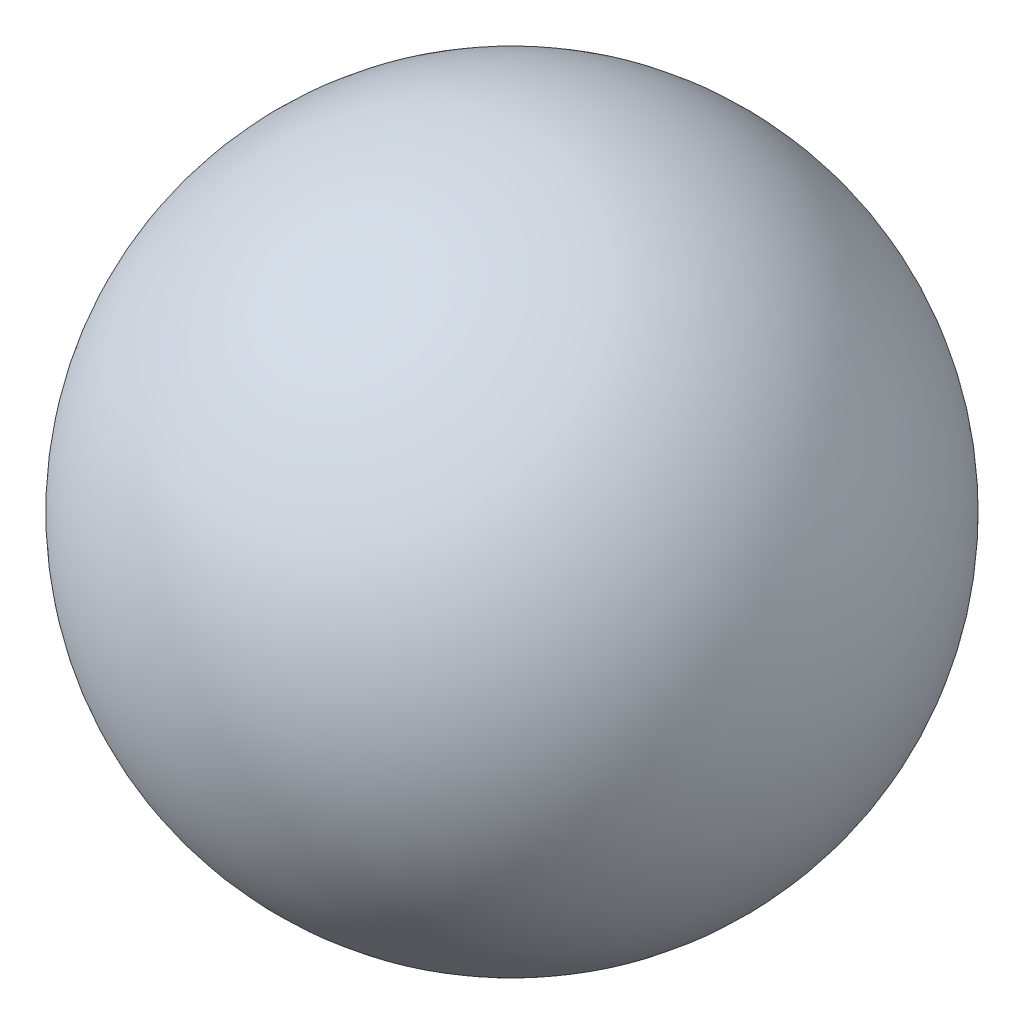
ISO-10303-21;
HEADER;
FILE_DESCRIPTION(('STEP AP214'),'2;1');
FILE_NAME('part.step','',(''),(''),'','','');
FILE_SCHEMA(('AUTOMOTIVE_DESIGN { 1 0 10303 214 1 1 1 1 }'));
ENDSEC;
DATA;
#1=APPLICATION_CONTEXT('core data for automotive mechanical design processes');
#2=APPLICATION_PROTOCOL_DEFINITION('international standard','automotive_design',2000,#1);
#3=PRODUCT_CONTEXT('',#1,'mechanical');
#4=PRODUCT('Part','Part','',(#3));
#5=PRODUCT_RELATED_PRODUCT_CATEGORY('part','',(#4));
#6=PRODUCT_DEFINITION_FORMATION('','',#4);
#7=PRODUCT_DEFINITION_CONTEXT('part definition',#1,'design');
#8=PRODUCT_DEFINITION('design','',#6,#7);
#9=PRODUCT_DEFINITION_SHAPE('','',#8);
#10=(LENGTH_UNIT() NAMED_UNIT(*) SI_UNIT(.MILLI.,.METRE.));
#11=(NAMED_UNIT(*) PLANE_ANGLE_UNIT() SI_UNIT($,.RADIAN.));
#12=(NAMED_UNIT(*) SI_UNIT($,.STERADIAN.) SOLID_ANGLE_UNIT());
#13=UNCERTAINTY_MEASURE_WITH_UNIT(LENGTH_MEASURE(1.E-05),#10,'distance_accuracy_value','');
#14=(GEOMETRIC_REPRESENTATION_CONTEXT(3) GLOBAL_UNCERTAINTY_ASSIGNED_CONTEXT((#13)) GLOBAL_UNIT_ASSIGNED_CONTEXT((#10,
#11,#12)) REPRESENTATION_CONTEXT('',''));
#15=CARTESIAN_POINT('',(0.,0.,0.));
#16=DIRECTION('',(0.,0.,1.));
#17=DIRECTION('',(1.,0.,0.));
#18=AXIS2_PLACEMENT_3D('',#15,#16,#17);
#19=CARTESIAN_POINT('',(0.,4.,0.));
#20=DIRECTION('',(0.,-1.,0.));
#21=DIRECTION('',(-1.,0.,0.));
#22=AXIS2_PLACEMENT_3D('',#19,#20,#21);
#23=SPHERICAL_SURFACE('',#22,4.);
#24=CARTESIAN_POINT('',(0.,0.,0.));
#25=VERTEX_POINT('',#24);
#26=VERTEX_LOOP('',#25);
#27=FACE_BOUND('',#26,.T.);
#28=ADVANCED_FACE('F33',(#27),#23,.T.);
#29=CLOSED_SHELL('',(#28));
#30=MANIFOLD_SOLID_BREP('B2',#29);
#31=ADVANCED_BREP_SHAPE_REPRESENTATION('',(#18,#30),#14);
#32=SHAPE_DEFINITION_REPRESENTATION(#9,#31);
ENDSEC;
END-ISO-10303-21;
